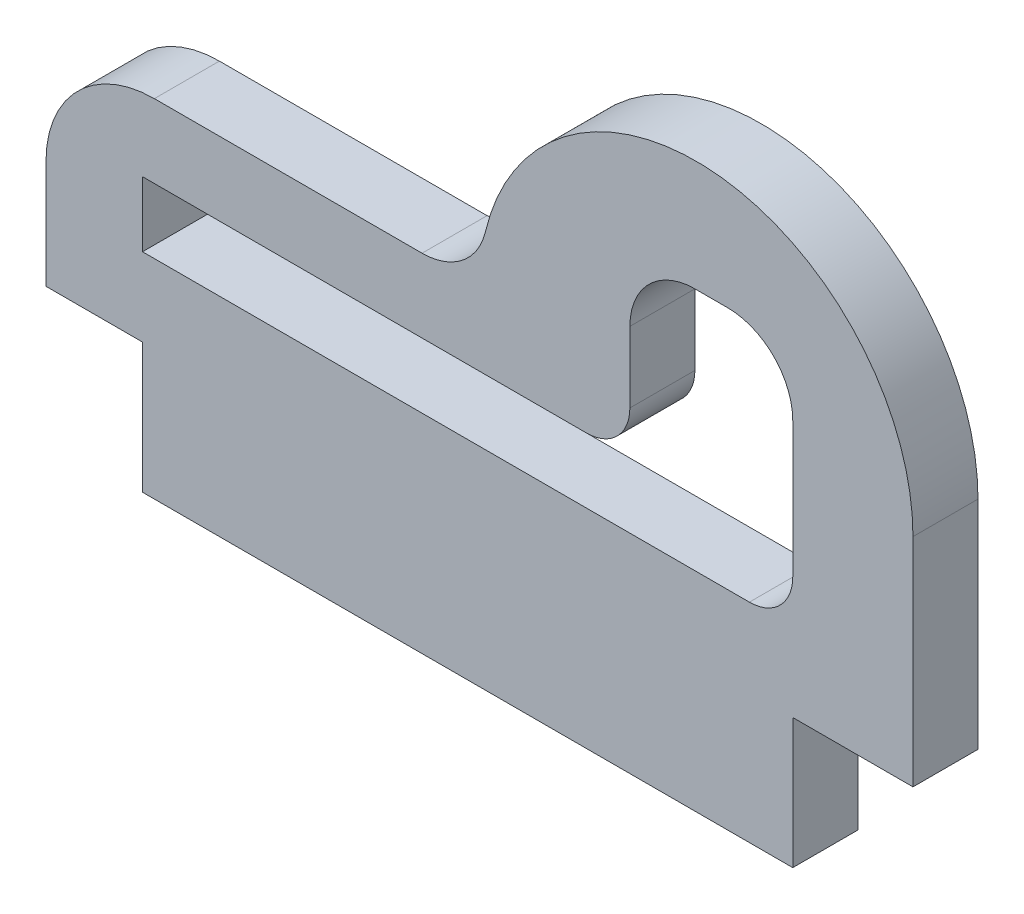
ISO-10303-21;
HEADER;
FILE_DESCRIPTION(('STEP AP214'),'2;1');
FILE_NAME('part.step','',(''),(''),'','','');
FILE_SCHEMA(('AUTOMOTIVE_DESIGN { 1 0 10303 214 1 1 1 1 }'));
ENDSEC;
DATA;
#1=APPLICATION_CONTEXT('core data for automotive mechanical design processes');
#2=APPLICATION_PROTOCOL_DEFINITION('international standard','automotive_design',2000,#1);
#3=PRODUCT_CONTEXT('',#1,'mechanical');
#4=PRODUCT('Part','Part','',(#3));
#5=PRODUCT_RELATED_PRODUCT_CATEGORY('part','',(#4));
#6=PRODUCT_DEFINITION_FORMATION('','',#4);
#7=PRODUCT_DEFINITION_CONTEXT('part definition',#1,'design');
#8=PRODUCT_DEFINITION('design','',#6,#7);
#9=PRODUCT_DEFINITION_SHAPE('','',#8);
#10=(LENGTH_UNIT() NAMED_UNIT(*) SI_UNIT(.MILLI.,.METRE.));
#11=(NAMED_UNIT(*) PLANE_ANGLE_UNIT() SI_UNIT($,.RADIAN.));
#12=(NAMED_UNIT(*) SI_UNIT($,.STERADIAN.) SOLID_ANGLE_UNIT());
#13=UNCERTAINTY_MEASURE_WITH_UNIT(LENGTH_MEASURE(1.E-05),#10,'distance_accuracy_value','');
#14=(GEOMETRIC_REPRESENTATION_CONTEXT(3) GLOBAL_UNCERTAINTY_ASSIGNED_CONTEXT((#13)) GLOBAL_UNIT_ASSIGNED_CONTEXT((#10,
#11,#12)) REPRESENTATION_CONTEXT('',''));
#15=CARTESIAN_POINT('',(0.,0.,0.));
#16=DIRECTION('',(0.,0.,1.));
#17=DIRECTION('',(1.,0.,0.));
#18=AXIS2_PLACEMENT_3D('',#15,#16,#17);
#19=CARTESIAN_POINT('',(10.,0.,3.));
#20=DIRECTION('',(0.,0.,1.));
#21=DIRECTION('',(1.,0.,0.));
#22=AXIS2_PLACEMENT_3D('',#19,#20,#21);
#23=PLANE('',#22);
#24=CARTESIAN_POINT('',(10.,0.,3.));
#25=DIRECTION('',(0.,0.,1.));
#26=DIRECTION('',(1.,0.,0.));
#27=AXIS2_PLACEMENT_3D('',#24,#25,#26);
#28=CIRCLE('',#27,10.);
#29=CARTESIAN_POINT('',(20.,0.,3.));
#30=VERTEX_POINT('',#29);
#31=CARTESIAN_POINT('',(0.269914891789601,2.30769230769231,3.));
#32=VERTEX_POINT('',#31);
#33=EDGE_CURVE('E291',#30,#32,#28,.T.);
#34=ORIENTED_EDGE('',*,*,#33,.T.);
#35=CARTESIAN_POINT('',(-2.64911064067352,3.,3.));
#36=DIRECTION('',(0.,0.,-1.));
#37=DIRECTION('',(1.,0.,0.));
#38=AXIS2_PLACEMENT_3D('',#35,#36,#37);
#39=CIRCLE('',#38,3.);
#40=CARTESIAN_POINT('',(-2.64911064067352,0.,3.));
#41=VERTEX_POINT('',#40);
#42=EDGE_CURVE('E295',#32,#41,#39,.T.);
#43=ORIENTED_EDGE('',*,*,#42,.T.);
#44=DIRECTION('',(-1.,0.,0.));
#45=VECTOR('',#44,1.);
#46=CARTESIAN_POINT('',(-2.64911064067352,0.,3.));
#47=LINE('',#46,#45);
#48=CARTESIAN_POINT('',(-15.,0.,3.));
#49=VERTEX_POINT('',#48);
#50=EDGE_CURVE('E299',#41,#49,#47,.T.);
#51=ORIENTED_EDGE('',*,*,#50,.T.);
#52=CARTESIAN_POINT('',(-15.,-5.,3.));
#53=DIRECTION('',(0.,0.,1.));
#54=DIRECTION('',(1.,0.,0.));
#55=AXIS2_PLACEMENT_3D('',#52,#53,#54);
#56=CIRCLE('',#55,5.);
#57=CARTESIAN_POINT('',(-20.,-5.00000000000004,3.));
#58=VERTEX_POINT('',#57);
#59=EDGE_CURVE('E302',#49,#58,#56,.T.);
#60=ORIENTED_EDGE('',*,*,#59,.T.);
#61=DIRECTION('',(0.,-1.,0.));
#62=VECTOR('',#61,1.);
#63=CARTESIAN_POINT('',(-20.,-5.00000000000004,3.));
#64=LINE('',#63,#62);
#65=CARTESIAN_POINT('',(-20.,-10.,3.));
#66=VERTEX_POINT('',#65);
#67=EDGE_CURVE('E305',#58,#66,#64,.T.);
#68=ORIENTED_EDGE('',*,*,#67,.T.);
#69=DIRECTION('',(1.,0.,0.));
#70=VECTOR('',#69,1.);
#71=CARTESIAN_POINT('',(-20.,-10.,3.));
#72=LINE('',#71,#70);
#73=CARTESIAN_POINT('',(-15.5468227424749,-10.,3.));
#74=VERTEX_POINT('',#73);
#75=EDGE_CURVE('E308',#66,#74,#72,.T.);
#76=ORIENTED_EDGE('',*,*,#75,.T.);
#77=DIRECTION('',(0.,-1.,0.));
#78=VECTOR('',#77,1.);
#79=CARTESIAN_POINT('',(-15.5468227424749,-10.,3.));
#80=LINE('',#79,#78);
#81=CARTESIAN_POINT('',(-15.5468227424749,-16.,3.));
#82=VERTEX_POINT('',#81);
#83=EDGE_CURVE('E311',#74,#82,#80,.T.);
#84=ORIENTED_EDGE('',*,*,#83,.T.);
#85=DIRECTION('',(1.,0.,0.));
#86=VECTOR('',#85,1.);
#87=CARTESIAN_POINT('',(-15.5468227424749,-16.,3.));
#88=LINE('',#87,#86);
#89=CARTESIAN_POINT('',(14.4531772575251,-16.,3.));
#90=VERTEX_POINT('',#89);
#91=EDGE_CURVE('E314',#82,#90,#88,.T.);
#92=ORIENTED_EDGE('',*,*,#91,.T.);
#93=DIRECTION('',(0.,1.,0.));
#94=VECTOR('',#93,1.);
#95=CARTESIAN_POINT('',(14.4531772575251,-10.,3.));
#96=LINE('',#95,#94);
#97=CARTESIAN_POINT('',(14.4531772575251,-10.,3.));
#98=VERTEX_POINT('',#97);
#99=EDGE_CURVE('E317',#90,#98,#96,.T.);
#100=ORIENTED_EDGE('',*,*,#99,.T.);
#101=DIRECTION('',(1.,0.,0.));
#102=VECTOR('',#101,1.);
#103=CARTESIAN_POINT('',(14.4531772575251,-10.,3.));
#104=LINE('',#103,#102);
#105=CARTESIAN_POINT('',(20.,-10.,3.));
#106=VERTEX_POINT('',#105);
#107=EDGE_CURVE('E320',#98,#106,#104,.T.);
#108=ORIENTED_EDGE('',*,*,#107,.T.);
#109=DIRECTION('',(0.,1.,0.));
#110=VECTOR('',#109,1.);
#111=CARTESIAN_POINT('',(20.,-10.,3.));
#112=LINE('',#111,#110);
#113=EDGE_CURVE('E323',#106,#30,#112,.T.);
#114=ORIENTED_EDGE('',*,*,#113,.T.);
#115=EDGE_LOOP('',(#34,#43,#51,#60,#68,#76,#84,#92,#100,#108,#114));
#116=FACE_BOUND('',#115,.T.);
#117=DIRECTION('',(-1.,0.,0.));
#118=VECTOR('',#117,1.);
#119=CARTESIAN_POINT('',(11.4531772575251,4.86956521739131,3.));
#120=LINE('',#119,#118);
#121=CARTESIAN_POINT('',(11.4531772575251,4.86956521739131,3.));
#122=VERTEX_POINT('',#121);
#123=CARTESIAN_POINT('',(9.93812709030103,4.86956521739131,3.));
#124=VERTEX_POINT('',#123);
#125=EDGE_CURVE('E203',#122,#124,#120,.T.);
#126=ORIENTED_EDGE('',*,*,#125,.F.);
#127=CARTESIAN_POINT('',(11.4531772575251,1.86956521739131,3.));
#128=DIRECTION('',(0.,0.,1.));
#129=DIRECTION('',(1.,0.,0.));
#130=AXIS2_PLACEMENT_3D('',#127,#128,#129);
#131=CIRCLE('',#130,3.);
#132=CARTESIAN_POINT('',(14.4531772575251,1.86956521739128,3.));
#133=VERTEX_POINT('',#132);
#134=EDGE_CURVE('E188',#133,#122,#131,.T.);
#135=ORIENTED_EDGE('',*,*,#134,.F.);
#136=DIRECTION('',(0.,1.,0.));
#137=VECTOR('',#136,1.);
#138=CARTESIAN_POINT('',(14.4531772575251,-3.39130434782609,3.));
#139=LINE('',#138,#137);
#140=CARTESIAN_POINT('',(14.4531772575251,-4.39130434782607,3.));
#141=VERTEX_POINT('',#140);
#142=EDGE_CURVE('E182',#141,#133,#139,.T.);
#143=ORIENTED_EDGE('',*,*,#142,.F.);
#144=CARTESIAN_POINT('',(12.4531772575251,-4.39130434782609,3.));
#145=DIRECTION('',(0.,0.,1.));
#146=DIRECTION('',(1.,0.,0.));
#147=AXIS2_PLACEMENT_3D('',#144,#145,#146);
#148=CIRCLE('',#147,2.);
#149=CARTESIAN_POINT('',(12.4531772575251,-6.39130434782609,3.));
#150=VERTEX_POINT('',#149);
#151=EDGE_CURVE('E227',#150,#141,#148,.T.);
#152=ORIENTED_EDGE('',*,*,#151,.F.);
#153=DIRECTION('',(1.,0.,0.));
#154=VECTOR('',#153,1.);
#155=CARTESIAN_POINT('',(-15.5468227424749,-6.39130434782609,3.));
#156=LINE('',#155,#154);
#157=CARTESIAN_POINT('',(-15.5468227424749,-6.39130434782609,3.));
#158=VERTEX_POINT('',#157);
#159=EDGE_CURVE('E224',#158,#150,#156,.T.);
#160=ORIENTED_EDGE('',*,*,#159,.F.);
#161=DIRECTION('',(0.,-1.,0.));
#162=VECTOR('',#161,1.);
#163=CARTESIAN_POINT('',(-15.5468227424749,-6.39130434782609,3.));
#164=LINE('',#163,#162);
#165=CARTESIAN_POINT('',(-15.5468227424749,-3.39130434782609,3.));
#166=VERTEX_POINT('',#165);
#167=EDGE_CURVE('E221',#166,#158,#164,.T.);
#168=ORIENTED_EDGE('',*,*,#167,.F.);
#169=DIRECTION('',(-1.,0.,0.));
#170=VECTOR('',#169,1.);
#171=CARTESIAN_POINT('',(-15.5468227424749,-3.39130434782609,3.));
#172=LINE('',#171,#170);
#173=CARTESIAN_POINT('',(4.93812709030099,-3.39130434782609,3.));
#174=VERTEX_POINT('',#173);
#175=EDGE_CURVE('E218',#174,#166,#172,.T.);
#176=ORIENTED_EDGE('',*,*,#175,.F.);
#177=CARTESIAN_POINT('',(4.938127090301,-1.39130434782609,3.));
#178=DIRECTION('',(0.,0.,-1.));
#179=DIRECTION('',(1.,0.,0.));
#180=AXIS2_PLACEMENT_3D('',#177,#178,#179);
#181=CIRCLE('',#180,2.);
#182=CARTESIAN_POINT('',(6.93812709030101,-1.39130434782609,3.));
#183=VERTEX_POINT('',#182);
#184=EDGE_CURVE('E215',#183,#174,#181,.T.);
#185=ORIENTED_EDGE('',*,*,#184,.F.);
#186=DIRECTION('',(0.,-1.,0.));
#187=VECTOR('',#186,1.);
#188=CARTESIAN_POINT('',(6.93812709030101,-1.39130434782607,3.));
#189=LINE('',#188,#187);
#190=CARTESIAN_POINT('',(6.93812709030101,1.86956521739128,3.));
#191=VERTEX_POINT('',#190);
#192=EDGE_CURVE('E212',#191,#183,#189,.T.);
#193=ORIENTED_EDGE('',*,*,#192,.F.);
#194=CARTESIAN_POINT('',(9.938127090301,1.86956521739131,3.));
#195=DIRECTION('',(0.,0.,1.));
#196=DIRECTION('',(-1.,0.,0.));
#197=AXIS2_PLACEMENT_3D('',#194,#195,#196);
#198=CIRCLE('',#197,3.);
#199=EDGE_CURVE('E207',#124,#191,#198,.T.);
#200=ORIENTED_EDGE('',*,*,#199,.F.);
#201=EDGE_LOOP('',(#126,#135,#143,#152,#160,#168,#176,#185,#193,#200));
#202=FACE_BOUND('',#201,.T.);
#203=ADVANCED_FACE('F41',(#116,#202),#23,.T.);
#204=CARTESIAN_POINT('',(10.,0.,0.));
#205=DIRECTION('',(0.,0.,1.));
#206=DIRECTION('',(1.,0.,0.));
#207=AXIS2_PLACEMENT_3D('',#204,#205,#206);
#208=PLANE('',#207);
#209=CARTESIAN_POINT('',(10.,0.,0.));
#210=DIRECTION('',(0.,0.,1.));
#211=DIRECTION('',(1.,0.,0.));
#212=AXIS2_PLACEMENT_3D('',#209,#210,#211);
#213=CIRCLE('',#212,10.);
#214=CARTESIAN_POINT('',(20.,0.,0.));
#215=VERTEX_POINT('',#214);
#216=CARTESIAN_POINT('',(0.269914891789601,2.30769230769231,0.));
#217=VERTEX_POINT('',#216);
#218=EDGE_CURVE('E198',#215,#217,#213,.T.);
#219=ORIENTED_EDGE('',*,*,#218,.F.);
#220=DIRECTION('',(0.,1.,0.));
#221=VECTOR('',#220,1.);
#222=CARTESIAN_POINT('',(20.,-10.,0.));
#223=LINE('',#222,#221);
#224=CARTESIAN_POINT('',(20.,-10.,0.));
#225=VERTEX_POINT('',#224);
#226=EDGE_CURVE('E296',#225,#215,#223,.T.);
#227=ORIENTED_EDGE('',*,*,#226,.F.);
#228=DIRECTION('',(1.,0.,0.));
#229=VECTOR('',#228,1.);
#230=CARTESIAN_POINT('',(14.4531772575251,-10.,0.));
#231=LINE('',#230,#229);
#232=CARTESIAN_POINT('',(14.4531772575251,-10.,0.));
#233=VERTEX_POINT('',#232);
#234=EDGE_CURVE('E354',#233,#225,#231,.T.);
#235=ORIENTED_EDGE('',*,*,#234,.F.);
#236=DIRECTION('',(0.,1.,0.));
#237=VECTOR('',#236,1.);
#238=CARTESIAN_POINT('',(14.4531772575251,-10.,0.));
#239=LINE('',#238,#237);
#240=CARTESIAN_POINT('',(14.4531772575251,-16.,0.));
#241=VERTEX_POINT('',#240);
#242=EDGE_CURVE('E351',#241,#233,#239,.T.);
#243=ORIENTED_EDGE('',*,*,#242,.F.);
#244=DIRECTION('',(1.,0.,0.));
#245=VECTOR('',#244,1.);
#246=CARTESIAN_POINT('',(-15.5468227424749,-16.,0.));
#247=LINE('',#246,#245);
#248=CARTESIAN_POINT('',(-15.5468227424749,-16.,0.));
#249=VERTEX_POINT('',#248);
#250=EDGE_CURVE('E348',#249,#241,#247,.T.);
#251=ORIENTED_EDGE('',*,*,#250,.F.);
#252=DIRECTION('',(0.,-1.,0.));
#253=VECTOR('',#252,1.);
#254=CARTESIAN_POINT('',(-15.5468227424749,-10.,0.));
#255=LINE('',#254,#253);
#256=CARTESIAN_POINT('',(-15.5468227424749,-10.,0.));
#257=VERTEX_POINT('',#256);
#258=EDGE_CURVE('E345',#257,#249,#255,.T.);
#259=ORIENTED_EDGE('',*,*,#258,.F.);
#260=DIRECTION('',(1.,0.,0.));
#261=VECTOR('',#260,1.);
#262=CARTESIAN_POINT('',(-20.,-10.,0.));
#263=LINE('',#262,#261);
#264=CARTESIAN_POINT('',(-20.,-10.,0.));
#265=VERTEX_POINT('',#264);
#266=EDGE_CURVE('E342',#265,#257,#263,.T.);
#267=ORIENTED_EDGE('',*,*,#266,.F.);
#268=DIRECTION('',(0.,-1.,0.));
#269=VECTOR('',#268,1.);
#270=CARTESIAN_POINT('',(-20.,-5.00000000000004,0.));
#271=LINE('',#270,#269);
#272=CARTESIAN_POINT('',(-20.,-5.00000000000004,0.));
#273=VERTEX_POINT('',#272);
#274=EDGE_CURVE('E339',#273,#265,#271,.T.);
#275=ORIENTED_EDGE('',*,*,#274,.F.);
#276=CARTESIAN_POINT('',(-15.,-5.,0.));
#277=DIRECTION('',(0.,0.,1.));
#278=DIRECTION('',(1.,0.,0.));
#279=AXIS2_PLACEMENT_3D('',#276,#277,#278);
#280=CIRCLE('',#279,5.);
#281=CARTESIAN_POINT('',(-15.,0.,0.));
#282=VERTEX_POINT('',#281);
#283=EDGE_CURVE('E336',#282,#273,#280,.T.);
#284=ORIENTED_EDGE('',*,*,#283,.F.);
#285=DIRECTION('',(-1.,0.,0.));
#286=VECTOR('',#285,1.);
#287=CARTESIAN_POINT('',(-2.64911064067352,0.,0.));
#288=LINE('',#287,#286);
#289=CARTESIAN_POINT('',(-2.64911064067352,0.,0.));
#290=VERTEX_POINT('',#289);
#291=EDGE_CURVE('E333',#290,#282,#288,.T.);
#292=ORIENTED_EDGE('',*,*,#291,.F.);
#293=CARTESIAN_POINT('',(-2.64911064067352,3.,0.));
#294=DIRECTION('',(0.,0.,-1.));
#295=DIRECTION('',(1.,0.,0.));
#296=AXIS2_PLACEMENT_3D('',#293,#294,#295);
#297=CIRCLE('',#296,3.);
#298=EDGE_CURVE('E330',#217,#290,#297,.T.);
#299=ORIENTED_EDGE('',*,*,#298,.F.);
#300=EDGE_LOOP('',(#219,#227,#235,#243,#251,#259,#267,#275,#284,#292,#299));
#301=FACE_BOUND('',#300,.T.);
#302=CARTESIAN_POINT('',(11.4531772575251,1.86956521739131,0.));
#303=DIRECTION('',(0.,0.,1.));
#304=DIRECTION('',(1.,0.,0.));
#305=AXIS2_PLACEMENT_3D('',#302,#303,#304);
#306=CIRCLE('',#305,3.);
#307=CARTESIAN_POINT('',(14.4531772575251,1.86956521739128,0.));
#308=VERTEX_POINT('',#307);
#309=CARTESIAN_POINT('',(11.4531772575251,4.86956521739131,0.));
#310=VERTEX_POINT('',#309);
#311=EDGE_CURVE('E195',#308,#310,#306,.T.);
#312=ORIENTED_EDGE('',*,*,#311,.T.);
#313=DIRECTION('',(-1.,0.,0.));
#314=VECTOR('',#313,1.);
#315=CARTESIAN_POINT('',(11.4531772575251,4.86956521739131,0.));
#316=LINE('',#315,#314);
#317=CARTESIAN_POINT('',(9.93812709030103,4.86956521739131,0.));
#318=VERTEX_POINT('',#317);
#319=EDGE_CURVE('E232',#310,#318,#316,.T.);
#320=ORIENTED_EDGE('',*,*,#319,.T.);
#321=CARTESIAN_POINT('',(9.938127090301,1.86956521739131,0.));
#322=DIRECTION('',(0.,0.,1.));
#323=DIRECTION('',(-1.,0.,0.));
#324=AXIS2_PLACEMENT_3D('',#321,#322,#323);
#325=CIRCLE('',#324,3.);
#326=CARTESIAN_POINT('',(6.93812709030101,1.86956521739128,0.));
#327=VERTEX_POINT('',#326);
#328=EDGE_CURVE('E236',#318,#327,#325,.T.);
#329=ORIENTED_EDGE('',*,*,#328,.T.);
#330=DIRECTION('',(0.,-1.,0.));
#331=VECTOR('',#330,1.);
#332=CARTESIAN_POINT('',(6.93812709030101,-1.39130434782607,0.));
#333=LINE('',#332,#331);
#334=CARTESIAN_POINT('',(6.93812709030101,-1.39130434782609,0.));
#335=VERTEX_POINT('',#334);
#336=EDGE_CURVE('E240',#327,#335,#333,.T.);
#337=ORIENTED_EDGE('',*,*,#336,.T.);
#338=CARTESIAN_POINT('',(4.938127090301,-1.39130434782609,0.));
#339=DIRECTION('',(0.,0.,-1.));
#340=DIRECTION('',(1.,0.,0.));
#341=AXIS2_PLACEMENT_3D('',#338,#339,#340);
#342=CIRCLE('',#341,2.);
#343=CARTESIAN_POINT('',(4.93812709030099,-3.39130434782609,0.));
#344=VERTEX_POINT('',#343);
#345=EDGE_CURVE('E244',#335,#344,#342,.T.);
#346=ORIENTED_EDGE('',*,*,#345,.T.);
#347=DIRECTION('',(-1.,0.,0.));
#348=VECTOR('',#347,1.);
#349=CARTESIAN_POINT('',(-15.5468227424749,-3.39130434782609,0.));
#350=LINE('',#349,#348);
#351=CARTESIAN_POINT('',(-15.5468227424749,-3.39130434782609,0.));
#352=VERTEX_POINT('',#351);
#353=EDGE_CURVE('E248',#344,#352,#350,.T.);
#354=ORIENTED_EDGE('',*,*,#353,.T.);
#355=DIRECTION('',(0.,-1.,0.));
#356=VECTOR('',#355,1.);
#357=CARTESIAN_POINT('',(-15.5468227424749,-6.39130434782609,0.));
#358=LINE('',#357,#356);
#359=CARTESIAN_POINT('',(-15.5468227424749,-6.39130434782609,0.));
#360=VERTEX_POINT('',#359);
#361=EDGE_CURVE('E252',#352,#360,#358,.T.);
#362=ORIENTED_EDGE('',*,*,#361,.T.);
#363=DIRECTION('',(1.,0.,0.));
#364=VECTOR('',#363,1.);
#365=CARTESIAN_POINT('',(-15.5468227424749,-6.39130434782609,0.));
#366=LINE('',#365,#364);
#367=CARTESIAN_POINT('',(12.4531772575251,-6.39130434782609,0.));
#368=VERTEX_POINT('',#367);
#369=EDGE_CURVE('E256',#360,#368,#366,.T.);
#370=ORIENTED_EDGE('',*,*,#369,.T.);
#371=CARTESIAN_POINT('',(12.4531772575251,-4.39130434782609,0.));
#372=DIRECTION('',(0.,0.,1.));
#373=DIRECTION('',(1.,0.,0.));
#374=AXIS2_PLACEMENT_3D('',#371,#372,#373);
#375=CIRCLE('',#374,2.);
#376=CARTESIAN_POINT('',(14.4531772575251,-4.39130434782607,0.));
#377=VERTEX_POINT('',#376);
#378=EDGE_CURVE('E260',#368,#377,#375,.T.);
#379=ORIENTED_EDGE('',*,*,#378,.T.);
#380=DIRECTION('',(0.,1.,0.));
#381=VECTOR('',#380,1.);
#382=CARTESIAN_POINT('',(14.4531772575251,-4.39130434782607,0.));
#383=LINE('',#382,#381);
#384=EDGE_CURVE('E189',#377,#308,#383,.T.);
#385=ORIENTED_EDGE('',*,*,#384,.T.);
#386=EDGE_LOOP('',(#312,#320,#329,#337,#346,#354,#362,#370,#379,#385));
#387=FACE_BOUND('',#386,.T.);
#388=ADVANCED_FACE('F405',(#301,#387),#208,.F.);
#389=CARTESIAN_POINT('',(10.,0.,3.));
#390=DIRECTION('',(0.,0.,-1.));
#391=DIRECTION('',(-1.,0.,0.));
#392=AXIS2_PLACEMENT_3D('',#389,#390,#391);
#393=CYLINDRICAL_SURFACE('',#392,10.);
#394=ORIENTED_EDGE('',*,*,#218,.T.);
#395=DIRECTION('',(0.,0.,-1.));
#396=VECTOR('',#395,1.);
#397=CARTESIAN_POINT('',(0.269914891789601,2.30769230769231,3.));
#398=LINE('',#397,#396);
#399=EDGE_CURVE('E11',#32,#217,#398,.T.);
#400=ORIENTED_EDGE('',*,*,#399,.F.);
#401=ORIENTED_EDGE('',*,*,#33,.F.);
#402=DIRECTION('',(0.,0.,-1.));
#403=VECTOR('',#402,1.);
#404=CARTESIAN_POINT('',(20.,0.,3.));
#405=LINE('',#404,#403);
#406=EDGE_CURVE('E326',#30,#215,#405,.T.);
#407=ORIENTED_EDGE('',*,*,#406,.T.);
#408=EDGE_LOOP('',(#394,#400,#401,#407));
#409=FACE_BOUND('',#408,.T.);
#410=ADVANCED_FACE('F43',(#409),#393,.T.);
#411=CARTESIAN_POINT('',(-2.64911064067352,3.,3.));
#412=DIRECTION('',(0.,0.,-1.));
#413=DIRECTION('',(-1.,0.,0.));
#414=AXIS2_PLACEMENT_3D('',#411,#412,#413);
#415=CYLINDRICAL_SURFACE('',#414,3.);
#416=ORIENTED_EDGE('',*,*,#298,.T.);
#417=DIRECTION('',(0.,0.,-1.));
#418=VECTOR('',#417,1.);
#419=CARTESIAN_POINT('',(-2.64911064067352,0.,3.));
#420=LINE('',#419,#418);
#421=EDGE_CURVE('E50',#41,#290,#420,.T.);
#422=ORIENTED_EDGE('',*,*,#421,.F.);
#423=ORIENTED_EDGE('',*,*,#42,.F.);
#424=ORIENTED_EDGE('',*,*,#399,.T.);
#425=EDGE_LOOP('',(#416,#422,#423,#424));
#426=FACE_BOUND('',#425,.T.);
#427=ADVANCED_FACE('F422',(#426),#415,.F.);
#428=CARTESIAN_POINT('',(-2.64911064067352,0.,3.));
#429=DIRECTION('',(0.,-1.,0.));
#430=DIRECTION('',(1.,0.,0.));
#431=AXIS2_PLACEMENT_3D('',#428,#429,#430);
#432=PLANE('',#431);
#433=ORIENTED_EDGE('',*,*,#291,.T.);
#434=DIRECTION('',(0.,0.,-1.));
#435=VECTOR('',#434,1.);
#436=CARTESIAN_POINT('',(-15.,0.,3.));
#437=LINE('',#436,#435);
#438=EDGE_CURVE('E390',#49,#282,#437,.T.);
#439=ORIENTED_EDGE('',*,*,#438,.F.);
#440=ORIENTED_EDGE('',*,*,#50,.F.);
#441=ORIENTED_EDGE('',*,*,#421,.T.);
#442=EDGE_LOOP('',(#433,#439,#440,#441));
#443=FACE_BOUND('',#442,.T.);
#444=ADVANCED_FACE('F399',(#443),#432,.F.);
#445=CARTESIAN_POINT('',(-15.,-5.,3.));
#446=DIRECTION('',(0.,0.,-1.));
#447=DIRECTION('',(-1.,0.,0.));
#448=AXIS2_PLACEMENT_3D('',#445,#446,#447);
#449=CYLINDRICAL_SURFACE('',#448,5.);
#450=ORIENTED_EDGE('',*,*,#283,.T.);
#451=DIRECTION('',(0.,0.,-1.));
#452=VECTOR('',#451,1.);
#453=CARTESIAN_POINT('',(-20.,-5.00000000000004,3.));
#454=LINE('',#453,#452);
#455=EDGE_CURVE('E386',#58,#273,#454,.T.);
#456=ORIENTED_EDGE('',*,*,#455,.F.);
#457=ORIENTED_EDGE('',*,*,#59,.F.);
#458=ORIENTED_EDGE('',*,*,#438,.T.);
#459=EDGE_LOOP('',(#450,#456,#457,#458));
#460=FACE_BOUND('',#459,.T.);
#461=ADVANCED_FACE('F411',(#460),#449,.T.);
#462=CARTESIAN_POINT('',(-20.,-5.00000000000004,3.));
#463=DIRECTION('',(1.,0.,0.));
#464=DIRECTION('',(0.,0.,-1.));
#465=AXIS2_PLACEMENT_3D('',#462,#463,#464);
#466=PLANE('',#465);
#467=ORIENTED_EDGE('',*,*,#274,.T.);
#468=DIRECTION('',(0.,0.,-1.));
#469=VECTOR('',#468,1.);
#470=CARTESIAN_POINT('',(-20.,-10.,3.));
#471=LINE('',#470,#469);
#472=EDGE_CURVE('E382',#66,#265,#471,.T.);
#473=ORIENTED_EDGE('',*,*,#472,.F.);
#474=ORIENTED_EDGE('',*,*,#67,.F.);
#475=ORIENTED_EDGE('',*,*,#455,.T.);
#476=EDGE_LOOP('',(#467,#473,#474,#475));
#477=FACE_BOUND('',#476,.T.);
#478=ADVANCED_FACE('F415',(#477),#466,.F.);
#479=CARTESIAN_POINT('',(-20.,-10.,3.));
#480=DIRECTION('',(0.,1.,0.));
#481=DIRECTION('',(0.,0.,1.));
#482=AXIS2_PLACEMENT_3D('',#479,#480,#481);
#483=PLANE('',#482);
#484=ORIENTED_EDGE('',*,*,#266,.T.);
#485=DIRECTION('',(0.,0.,-1.));
#486=VECTOR('',#485,1.);
#487=CARTESIAN_POINT('',(-15.5468227424749,-10.,3.));
#488=LINE('',#487,#486);
#489=EDGE_CURVE('E378',#74,#257,#488,.T.);
#490=ORIENTED_EDGE('',*,*,#489,.F.);
#491=ORIENTED_EDGE('',*,*,#75,.F.);
#492=ORIENTED_EDGE('',*,*,#472,.T.);
#493=EDGE_LOOP('',(#484,#490,#491,#492));
#494=FACE_BOUND('',#493,.T.);
#495=ADVANCED_FACE('F450',(#494),#483,.F.);
#496=CARTESIAN_POINT('',(-15.5468227424749,-10.,3.));
#497=DIRECTION('',(1.,0.,0.));
#498=DIRECTION('',(0.,0.,-1.));
#499=AXIS2_PLACEMENT_3D('',#496,#497,#498);
#500=PLANE('',#499);
#501=ORIENTED_EDGE('',*,*,#258,.T.);
#502=DIRECTION('',(0.,0.,-1.));
#503=VECTOR('',#502,1.);
#504=CARTESIAN_POINT('',(-15.5468227424749,-16.,3.));
#505=LINE('',#504,#503);
#506=EDGE_CURVE('E374',#82,#249,#505,.T.);
#507=ORIENTED_EDGE('',*,*,#506,.F.);
#508=ORIENTED_EDGE('',*,*,#83,.F.);
#509=ORIENTED_EDGE('',*,*,#489,.T.);
#510=EDGE_LOOP('',(#501,#507,#508,#509));
#511=FACE_BOUND('',#510,.T.);
#512=ADVANCED_FACE('F448',(#511),#500,.F.);
#513=CARTESIAN_POINT('',(-15.5468227424749,-16.,3.));
#514=DIRECTION('',(0.,1.,0.));
#515=DIRECTION('',(0.,0.,1.));
#516=AXIS2_PLACEMENT_3D('',#513,#514,#515);
#517=PLANE('',#516);
#518=ORIENTED_EDGE('',*,*,#250,.T.);
#519=DIRECTION('',(0.,0.,-1.));
#520=VECTOR('',#519,1.);
#521=CARTESIAN_POINT('',(14.4531772575251,-16.,3.));
#522=LINE('',#521,#520);
#523=EDGE_CURVE('E370',#90,#241,#522,.T.);
#524=ORIENTED_EDGE('',*,*,#523,.F.);
#525=ORIENTED_EDGE('',*,*,#91,.F.);
#526=ORIENTED_EDGE('',*,*,#506,.T.);
#527=EDGE_LOOP('',(#518,#524,#525,#526));
#528=FACE_BOUND('',#527,.T.);
#529=ADVANCED_FACE('F443',(#528),#517,.F.);
#530=CARTESIAN_POINT('',(14.4531772575251,-10.,3.));
#531=DIRECTION('',(-1.,0.,0.));
#532=DIRECTION('',(0.,0.,1.));
#533=AXIS2_PLACEMENT_3D('',#530,#531,#532);
#534=PLANE('',#533);
#535=ORIENTED_EDGE('',*,*,#242,.T.);
#536=DIRECTION('',(0.,0.,-1.));
#537=VECTOR('',#536,1.);
#538=CARTESIAN_POINT('',(14.4531772575251,-10.,3.));
#539=LINE('',#538,#537);
#540=EDGE_CURVE('E366',#98,#233,#539,.T.);
#541=ORIENTED_EDGE('',*,*,#540,.F.);
#542=ORIENTED_EDGE('',*,*,#99,.F.);
#543=ORIENTED_EDGE('',*,*,#523,.T.);
#544=EDGE_LOOP('',(#535,#541,#542,#543));
#545=FACE_BOUND('',#544,.T.);
#546=ADVANCED_FACE('F438',(#545),#534,.F.);
#547=CARTESIAN_POINT('',(14.4531772575251,-10.,3.));
#548=DIRECTION('',(0.,1.,0.));
#549=DIRECTION('',(0.,0.,1.));
#550=AXIS2_PLACEMENT_3D('',#547,#548,#549);
#551=PLANE('',#550);
#552=ORIENTED_EDGE('',*,*,#234,.T.);
#553=DIRECTION('',(0.,0.,-1.));
#554=VECTOR('',#553,1.);
#555=CARTESIAN_POINT('',(20.,-10.,3.));
#556=LINE('',#555,#554);
#557=EDGE_CURVE('E362',#106,#225,#556,.T.);
#558=ORIENTED_EDGE('',*,*,#557,.F.);
#559=ORIENTED_EDGE('',*,*,#107,.F.);
#560=ORIENTED_EDGE('',*,*,#540,.T.);
#561=EDGE_LOOP('',(#552,#558,#559,#560));
#562=FACE_BOUND('',#561,.T.);
#563=ADVANCED_FACE('F434',(#562),#551,.F.);
#564=CARTESIAN_POINT('',(20.,-10.,3.));
#565=DIRECTION('',(-1.,0.,0.));
#566=DIRECTION('',(0.,-1.,0.));
#567=AXIS2_PLACEMENT_3D('',#564,#565,#566);
#568=PLANE('',#567);
#569=ORIENTED_EDGE('',*,*,#226,.T.);
#570=ORIENTED_EDGE('',*,*,#406,.F.);
#571=ORIENTED_EDGE('',*,*,#113,.F.);
#572=ORIENTED_EDGE('',*,*,#557,.T.);
#573=EDGE_LOOP('',(#569,#570,#571,#572));
#574=FACE_BOUND('',#573,.T.);
#575=ADVANCED_FACE('F429',(#574),#568,.F.);
#576=CARTESIAN_POINT('',(11.4531772575251,1.86956521739131,3.));
#577=DIRECTION('',(0.,0.,-1.));
#578=DIRECTION('',(-1.,0.,0.));
#579=AXIS2_PLACEMENT_3D('',#576,#577,#578);
#580=CYLINDRICAL_SURFACE('',#579,3.);
#581=ORIENTED_EDGE('',*,*,#311,.F.);
#582=DIRECTION('',(0.,0.,-1.));
#583=VECTOR('',#582,1.);
#584=CARTESIAN_POINT('',(14.4531772575251,1.86956521739128,3.));
#585=LINE('',#584,#583);
#586=EDGE_CURVE('E62',#133,#308,#585,.T.);
#587=ORIENTED_EDGE('',*,*,#586,.F.);
#588=ORIENTED_EDGE('',*,*,#134,.T.);
#589=DIRECTION('',(0.,0.,-1.));
#590=VECTOR('',#589,1.);
#591=CARTESIAN_POINT('',(11.4531772575251,4.86956521739131,3.));
#592=LINE('',#591,#590);
#593=EDGE_CURVE('E199',#122,#310,#592,.T.);
#594=ORIENTED_EDGE('',*,*,#593,.T.);
#595=EDGE_LOOP('',(#581,#587,#588,#594));
#596=FACE_BOUND('',#595,.T.);
#597=ADVANCED_FACE('F192',(#596),#580,.F.);
#598=CARTESIAN_POINT('',(11.4531772575251,4.86956521739131,3.));
#599=DIRECTION('',(0.,-1.,0.));
#600=DIRECTION('',(0.,0.,-1.));
#601=AXIS2_PLACEMENT_3D('',#598,#599,#600);
#602=PLANE('',#601);
#603=ORIENTED_EDGE('',*,*,#319,.F.);
#604=ORIENTED_EDGE('',*,*,#593,.F.);
#605=ORIENTED_EDGE('',*,*,#125,.T.);
#606=DIRECTION('',(0.,0.,-1.));
#607=VECTOR('',#606,1.);
#608=CARTESIAN_POINT('',(9.93812709030103,4.86956521739131,3.));
#609=LINE('',#608,#607);
#610=EDGE_CURVE('E286',#124,#318,#609,.T.);
#611=ORIENTED_EDGE('',*,*,#610,.T.);
#612=EDGE_LOOP('',(#603,#604,#605,#611));
#613=FACE_BOUND('',#612,.T.);
#614=ADVANCED_FACE('F497',(#613),#602,.T.);
#615=CARTESIAN_POINT('',(9.938127090301,1.86956521739131,3.));
#616=DIRECTION('',(0.,0.,-1.));
#617=DIRECTION('',(-1.,0.,0.));
#618=AXIS2_PLACEMENT_3D('',#615,#616,#617);
#619=CYLINDRICAL_SURFACE('',#618,3.);
#620=ORIENTED_EDGE('',*,*,#328,.F.);
#621=ORIENTED_EDGE('',*,*,#610,.F.);
#622=ORIENTED_EDGE('',*,*,#199,.T.);
#623=DIRECTION('',(0.,0.,-1.));
#624=VECTOR('',#623,1.);
#625=CARTESIAN_POINT('',(6.93812709030101,1.86956521739128,3.));
#626=LINE('',#625,#624);
#627=EDGE_CURVE('E283',#191,#327,#626,.T.);
#628=ORIENTED_EDGE('',*,*,#627,.T.);
#629=EDGE_LOOP('',(#620,#621,#622,#628));
#630=FACE_BOUND('',#629,.T.);
#631=ADVANCED_FACE('F503',(#630),#619,.F.);
#632=CARTESIAN_POINT('',(6.93812709030101,-1.39130434782607,3.));
#633=DIRECTION('',(1.,0.,0.));
#634=DIRECTION('',(0.,0.,-1.));
#635=AXIS2_PLACEMENT_3D('',#632,#633,#634);
#636=PLANE('',#635);
#637=ORIENTED_EDGE('',*,*,#336,.F.);
#638=ORIENTED_EDGE('',*,*,#627,.F.);
#639=ORIENTED_EDGE('',*,*,#192,.T.);
#640=DIRECTION('',(0.,0.,-1.));
#641=VECTOR('',#640,1.);
#642=CARTESIAN_POINT('',(6.93812709030101,-1.39130434782609,3.));
#643=LINE('',#642,#641);
#644=EDGE_CURVE('E280',#183,#335,#643,.T.);
#645=ORIENTED_EDGE('',*,*,#644,.T.);
#646=EDGE_LOOP('',(#637,#638,#639,#645));
#647=FACE_BOUND('',#646,.T.);
#648=ADVANCED_FACE('F510',(#647),#636,.T.);
#649=CARTESIAN_POINT('',(4.938127090301,-1.39130434782609,3.));
#650=DIRECTION('',(0.,0.,-1.));
#651=DIRECTION('',(-1.,0.,0.));
#652=AXIS2_PLACEMENT_3D('',#649,#650,#651);
#653=CYLINDRICAL_SURFACE('',#652,2.);
#654=ORIENTED_EDGE('',*,*,#345,.F.);
#655=ORIENTED_EDGE('',*,*,#644,.F.);
#656=ORIENTED_EDGE('',*,*,#184,.T.);
#657=DIRECTION('',(0.,0.,-1.));
#658=VECTOR('',#657,1.);
#659=CARTESIAN_POINT('',(4.93812709030099,-3.39130434782609,3.));
#660=LINE('',#659,#658);
#661=EDGE_CURVE('E277',#174,#344,#660,.T.);
#662=ORIENTED_EDGE('',*,*,#661,.T.);
#663=EDGE_LOOP('',(#654,#655,#656,#662));
#664=FACE_BOUND('',#663,.T.);
#665=ADVANCED_FACE('F518',(#664),#653,.T.);
#666=CARTESIAN_POINT('',(-15.5468227424749,-3.39130434782609,3.));
#667=DIRECTION('',(0.,-1.,0.));
#668=DIRECTION('',(0.,0.,-1.));
#669=AXIS2_PLACEMENT_3D('',#666,#667,#668);
#670=PLANE('',#669);
#671=ORIENTED_EDGE('',*,*,#353,.F.);
#672=ORIENTED_EDGE('',*,*,#661,.F.);
#673=ORIENTED_EDGE('',*,*,#175,.T.);
#674=DIRECTION('',(0.,0.,-1.));
#675=VECTOR('',#674,1.);
#676=CARTESIAN_POINT('',(-15.5468227424749,-3.39130434782609,3.));
#677=LINE('',#676,#675);
#678=EDGE_CURVE('E274',#166,#352,#677,.T.);
#679=ORIENTED_EDGE('',*,*,#678,.T.);
#680=EDGE_LOOP('',(#671,#672,#673,#679));
#681=FACE_BOUND('',#680,.T.);
#682=ADVANCED_FACE('F526',(#681),#670,.T.);
#683=CARTESIAN_POINT('',(-15.5468227424749,-6.39130434782609,3.));
#684=DIRECTION('',(1.,0.,0.));
#685=DIRECTION('',(0.,0.,-1.));
#686=AXIS2_PLACEMENT_3D('',#683,#684,#685);
#687=PLANE('',#686);
#688=ORIENTED_EDGE('',*,*,#361,.F.);
#689=ORIENTED_EDGE('',*,*,#678,.F.);
#690=ORIENTED_EDGE('',*,*,#167,.T.);
#691=DIRECTION('',(0.,0.,-1.));
#692=VECTOR('',#691,1.);
#693=CARTESIAN_POINT('',(-15.5468227424749,-6.39130434782609,3.));
#694=LINE('',#693,#692);
#695=EDGE_CURVE('E271',#158,#360,#694,.T.);
#696=ORIENTED_EDGE('',*,*,#695,.T.);
#697=EDGE_LOOP('',(#688,#689,#690,#696));
#698=FACE_BOUND('',#697,.T.);
#699=ADVANCED_FACE('F534',(#698),#687,.T.);
#700=CARTESIAN_POINT('',(-15.5468227424749,-6.39130434782609,3.));
#701=DIRECTION('',(0.,1.,0.));
#702=DIRECTION('',(0.,0.,1.));
#703=AXIS2_PLACEMENT_3D('',#700,#701,#702);
#704=PLANE('',#703);
#705=ORIENTED_EDGE('',*,*,#369,.F.);
#706=ORIENTED_EDGE('',*,*,#695,.F.);
#707=ORIENTED_EDGE('',*,*,#159,.T.);
#708=DIRECTION('',(0.,0.,-1.));
#709=VECTOR('',#708,1.);
#710=CARTESIAN_POINT('',(12.4531772575251,-6.39130434782609,3.));
#711=LINE('',#710,#709);
#712=EDGE_CURVE('E268',#150,#368,#711,.T.);
#713=ORIENTED_EDGE('',*,*,#712,.T.);
#714=EDGE_LOOP('',(#705,#706,#707,#713));
#715=FACE_BOUND('',#714,.T.);
#716=ADVANCED_FACE('F542',(#715),#704,.T.);
#717=CARTESIAN_POINT('',(12.4531772575251,-4.39130434782609,3.));
#718=DIRECTION('',(0.,0.,-1.));
#719=DIRECTION('',(-1.,0.,0.));
#720=AXIS2_PLACEMENT_3D('',#717,#718,#719);
#721=CYLINDRICAL_SURFACE('',#720,2.);
#722=ORIENTED_EDGE('',*,*,#378,.F.);
#723=ORIENTED_EDGE('',*,*,#712,.F.);
#724=ORIENTED_EDGE('',*,*,#151,.T.);
#725=DIRECTION('',(0.,0.,-1.));
#726=VECTOR('',#725,1.);
#727=CARTESIAN_POINT('',(14.4531772575251,-4.39130434782607,3.));
#728=LINE('',#727,#726);
#729=EDGE_CURVE('E57',#141,#377,#728,.T.);
#730=ORIENTED_EDGE('',*,*,#729,.T.);
#731=EDGE_LOOP('',(#722,#723,#724,#730));
#732=FACE_BOUND('',#731,.T.);
#733=ADVANCED_FACE('F550',(#732),#721,.F.);
#734=CARTESIAN_POINT('',(14.4531772575251,-4.39130434782607,3.));
#735=DIRECTION('',(-1.,0.,0.));
#736=DIRECTION('',(0.,0.,1.));
#737=AXIS2_PLACEMENT_3D('',#734,#735,#736);
#738=PLANE('',#737);
#739=ORIENTED_EDGE('',*,*,#384,.F.);
#740=ORIENTED_EDGE('',*,*,#729,.F.);
#741=ORIENTED_EDGE('',*,*,#142,.T.);
#742=ORIENTED_EDGE('',*,*,#586,.T.);
#743=EDGE_LOOP('',(#739,#740,#741,#742));
#744=FACE_BOUND('',#743,.T.);
#745=ADVANCED_FACE('F183',(#744),#738,.T.);
#746=CLOSED_SHELL('',(#203,#388,#410,#427,#444,#461,#478,#495,#512,#529,#546,#563,#575,#597,
#614,#631,#648,#665,#682,#699,#716,#733,#745));
#747=MANIFOLD_SOLID_BREP('B2',#746);
#748=ADVANCED_BREP_SHAPE_REPRESENTATION('',(#18,#747),#14);
#749=SHAPE_DEFINITION_REPRESENTATION(#9,#748);
ENDSEC;
END-ISO-10303-21;
